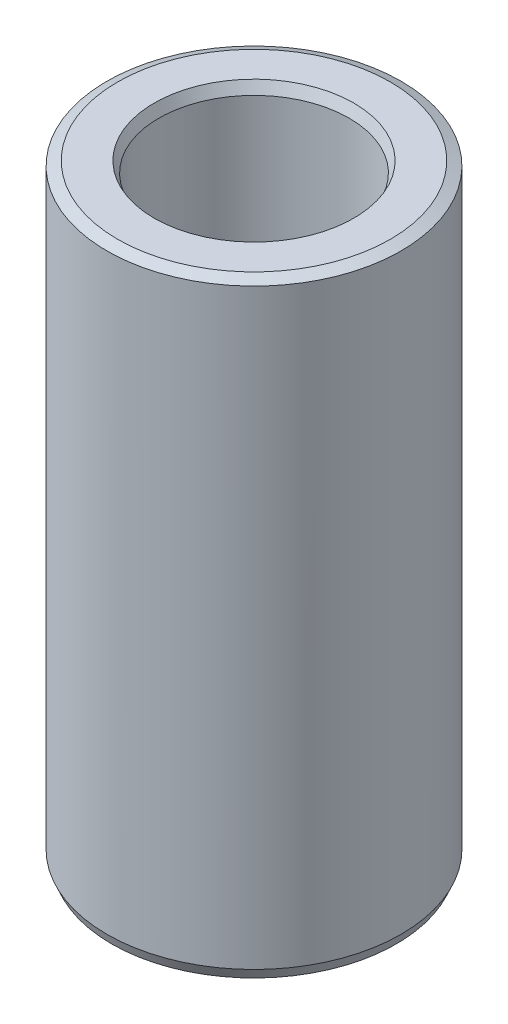
ISO-10303-21;
HEADER;
FILE_DESCRIPTION(('STEP AP214'),'2;1');
FILE_NAME('part.step','',(''),(''),'','','');
FILE_SCHEMA(('AUTOMOTIVE_DESIGN { 1 0 10303 214 1 1 1 1 }'));
ENDSEC;
DATA;
#1=APPLICATION_CONTEXT('core data for automotive mechanical design processes');
#2=APPLICATION_PROTOCOL_DEFINITION('international standard','automotive_design',2000,#1);
#3=PRODUCT_CONTEXT('',#1,'mechanical');
#4=PRODUCT('Part','Part','',(#3));
#5=PRODUCT_RELATED_PRODUCT_CATEGORY('part','',(#4));
#6=PRODUCT_DEFINITION_FORMATION('','',#4);
#7=PRODUCT_DEFINITION_CONTEXT('part definition',#1,'design');
#8=PRODUCT_DEFINITION('design','',#6,#7);
#9=PRODUCT_DEFINITION_SHAPE('','',#8);
#10=(LENGTH_UNIT() NAMED_UNIT(*) SI_UNIT(.MILLI.,.METRE.));
#11=(NAMED_UNIT(*) PLANE_ANGLE_UNIT() SI_UNIT($,.RADIAN.));
#12=(NAMED_UNIT(*) SI_UNIT($,.STERADIAN.) SOLID_ANGLE_UNIT());
#13=UNCERTAINTY_MEASURE_WITH_UNIT(LENGTH_MEASURE(1.E-05),#10,'distance_accuracy_value','');
#14=(GEOMETRIC_REPRESENTATION_CONTEXT(3) GLOBAL_UNCERTAINTY_ASSIGNED_CONTEXT((#13)) GLOBAL_UNIT_ASSIGNED_CONTEXT((#10,
#11,#12)) REPRESENTATION_CONTEXT('',''));
#15=CARTESIAN_POINT('',(0.,0.,0.));
#16=DIRECTION('',(0.,0.,1.));
#17=DIRECTION('',(1.,0.,0.));
#18=AXIS2_PLACEMENT_3D('',#15,#16,#17);
#19=CARTESIAN_POINT('',(0.,123.885257495903,0.));
#20=DIRECTION('',(0.,-1.,0.));
#21=DIRECTION('',(0.,0.,-1.));
#22=AXIS2_PLACEMENT_3D('',#19,#20,#21);
#23=CYLINDRICAL_SURFACE('',#22,30.);
#24=CARTESIAN_POINT('',(0.,2.1864745211929,0.));
#25=DIRECTION('',(0.,1.,0.));
#26=DIRECTION('',(0.,0.,1.));
#27=AXIS2_PLACEMENT_3D('',#24,#25,#26);
#28=CIRCLE('',#27,30.);
#29=CARTESIAN_POINT('',(0.,2.1864745211929,30.));
#30=VERTEX_POINT('',#29);
#31=EDGE_CURVE('E10',#30,#30,#28,.T.);
#32=ORIENTED_EDGE('',*,*,#31,.T.);
#33=EDGE_LOOP('',(#32));
#34=FACE_BOUND('',#33,.T.);
#35=CARTESIAN_POINT('',(0.,122.923997597913,0.));
#36=DIRECTION('',(0.,1.,0.));
#37=DIRECTION('',(0.,0.,1.));
#38=AXIS2_PLACEMENT_3D('',#35,#36,#37);
#39=CIRCLE('',#38,30.);
#40=CARTESIAN_POINT('',(0.,122.923997597913,-30.));
#41=VERTEX_POINT('',#40);
#42=EDGE_CURVE('E50',#41,#41,#39,.F.);
#43=ORIENTED_EDGE('',*,*,#42,.T.);
#44=EDGE_LOOP('',(#43));
#45=FACE_BOUND('',#44,.T.);
#46=ADVANCED_FACE('F39',(#34,#45),#23,.T.);
#47=CARTESIAN_POINT('',(0.,123.885257495903,0.));
#48=DIRECTION('',(0.,1.,0.));
#49=DIRECTION('',(0.,0.,1.));
#50=AXIS2_PLACEMENT_3D('',#47,#48,#49);
#51=PLANE('',#50);
#52=CARTESIAN_POINT('',(0.,123.885257495903,0.));
#53=DIRECTION('',(0.,1.,0.));
#54=DIRECTION('',(0.,0.,1.));
#55=AXIS2_PLACEMENT_3D('',#52,#53,#54);
#56=CIRCLE('',#55,20.3596697328622);
#57=CARTESIAN_POINT('',(0.,123.885257495903,20.3596697328622));
#58=VERTEX_POINT('',#57);
#59=EDGE_CURVE('E58',#58,#58,#56,.F.);
#60=ORIENTED_EDGE('',*,*,#59,.T.);
#61=EDGE_LOOP('',(#60));
#62=FACE_BOUND('',#61,.T.);
#63=CARTESIAN_POINT('',(0.,123.885257495903,0.));
#64=DIRECTION('',(0.,1.,0.));
#65=DIRECTION('',(0.,0.,1.));
#66=AXIS2_PLACEMENT_3D('',#63,#64,#65);
#67=CIRCLE('',#66,27.813525478807);
#68=CARTESIAN_POINT('',(0.,123.885257495903,-27.813525478807));
#69=VERTEX_POINT('',#68);
#70=EDGE_CURVE('E61',#69,#69,#67,.T.);
#71=ORIENTED_EDGE('',*,*,#70,.T.);
#72=EDGE_LOOP('',(#71));
#73=FACE_BOUND('',#72,.T.);
#74=ADVANCED_FACE('F88',(#62,#73),#51,.T.);
#75=CARTESIAN_POINT('',(0.,0.,0.));
#76=DIRECTION('',(0.,1.,0.));
#77=DIRECTION('',(0.,0.,1.));
#78=AXIS2_PLACEMENT_3D('',#75,#76,#77);
#79=PLANE('',#78);
#80=CARTESIAN_POINT('',(0.,0.,0.));
#81=DIRECTION('',(0.,1.,0.));
#82=DIRECTION('',(0.,0.,1.));
#83=AXIS2_PLACEMENT_3D('',#80,#81,#82);
#84=CIRCLE('',#83,21.5848843560652);
#85=CARTESIAN_POINT('',(0.,0.,-21.5848843560652));
#86=VERTEX_POINT('',#85);
#87=EDGE_CURVE('E51',#86,#86,#84,.T.);
#88=ORIENTED_EDGE('',*,*,#87,.T.);
#89=EDGE_LOOP('',(#88));
#90=FACE_BOUND('',#89,.T.);
#91=CARTESIAN_POINT('',(0.,0.,0.));
#92=DIRECTION('',(0.,1.,0.));
#93=DIRECTION('',(0.,0.,1.));
#94=AXIS2_PLACEMENT_3D('',#91,#92,#93);
#95=CIRCLE('',#94,29.0387401020101);
#96=CARTESIAN_POINT('',(0.,0.,29.0387401020101));
#97=VERTEX_POINT('',#96);
#98=EDGE_CURVE('E54',#97,#97,#95,.F.);
#99=ORIENTED_EDGE('',*,*,#98,.T.);
#100=EDGE_LOOP('',(#99));
#101=FACE_BOUND('',#100,.T.);
#102=ADVANCED_FACE('F83',(#90,#101),#79,.F.);
#103=CARTESIAN_POINT('',(0.,123.885257495903,0.));
#104=DIRECTION('',(0.,-1.,0.));
#105=DIRECTION('',(0.,0.,-1.));
#106=AXIS2_PLACEMENT_3D('',#103,#104,#105);
#107=CYLINDRICAL_SURFACE('',#106,19.3984098348722);
#108=CARTESIAN_POINT('',(0.,121.69878297471,0.));
#109=DIRECTION('',(0.,1.,0.));
#110=DIRECTION('',(0.,0.,1.));
#111=AXIS2_PLACEMENT_3D('',#108,#109,#110);
#112=CIRCLE('',#111,19.3984098348722);
#113=CARTESIAN_POINT('',(0.,121.69878297471,19.3984098348722));
#114=VERTEX_POINT('',#113);
#115=EDGE_CURVE('E67',#114,#114,#112,.T.);
#116=ORIENTED_EDGE('',*,*,#115,.T.);
#117=EDGE_LOOP('',(#116));
#118=FACE_BOUND('',#117,.T.);
#119=CARTESIAN_POINT('',(0.,0.961259897989966,0.));
#120=DIRECTION('',(0.,1.,0.));
#121=DIRECTION('',(0.,0.,1.));
#122=AXIS2_PLACEMENT_3D('',#119,#120,#121);
#123=CIRCLE('',#122,19.3984098348722);
#124=CARTESIAN_POINT('',(0.,0.961259897989966,-19.3984098348722));
#125=VERTEX_POINT('',#124);
#126=EDGE_CURVE('E69',#125,#125,#123,.F.);
#127=ORIENTED_EDGE('',*,*,#126,.T.);
#128=EDGE_LOOP('',(#127));
#129=FACE_BOUND('',#128,.T.);
#130=ADVANCED_FACE('F71',(#118,#129),#107,.F.);
#131=CARTESIAN_POINT('',(0.,121.69878297471,0.));
#132=DIRECTION('',(0.,1.,0.));
#133=DIRECTION('',(0.,0.,1.));
#134=AXIS2_PLACEMENT_3D('',#131,#132,#133);
#135=CONICAL_SURFACE('',#134,19.3984098348722,0.414204551222729);
#136=ORIENTED_EDGE('',*,*,#59,.F.);
#137=EDGE_LOOP('',(#136));
#138=FACE_BOUND('',#137,.T.);
#139=ORIENTED_EDGE('',*,*,#115,.F.);
#140=EDGE_LOOP('',(#139));
#141=FACE_BOUND('',#140,.T.);
#142=ADVANCED_FACE('F77',(#138,#141),#135,.F.);
#143=CARTESIAN_POINT('',(0.,0.,0.));
#144=DIRECTION('',(0.,-1.,0.));
#145=DIRECTION('',(0.,0.,-1.));
#146=AXIS2_PLACEMENT_3D('',#143,#144,#145);
#147=CONICAL_SURFACE('',#146,21.5848843560652,1.15659177557217);
#148=CARTESIAN_POINT('',(0.,0.961259897989966,-19.3984098348722));
#149=CARTESIAN_POINT('',(0.,0.951246774052571,-19.4211856111346));
#150=CARTESIAN_POINT('',(0.,0.941233650115175,-19.443961387397));
#151=CARTESIAN_POINT('',(0.,0.921207402240384,-19.4895129399219));
#152=CARTESIAN_POINT('',(0.,0.911194278302989,-19.5122887161843));
#153=CARTESIAN_POINT('',(0.,0.891168030428198,-19.5578402687092));
#154=CARTESIAN_POINT('',(0.,0.881154906490802,-19.5806160449716));
#155=CARTESIAN_POINT('',(0.,0.861128658616011,-19.6261675974965));
#156=CARTESIAN_POINT('',(0.,0.851115534678616,-19.6489433737589));
#157=CARTESIAN_POINT('',(0.,0.831089286803825,-19.6944949262838));
#158=CARTESIAN_POINT('',(0.,0.821076162866429,-19.7172707025462));
#159=CARTESIAN_POINT('',(0.,0.801049914991638,-19.762822255071));
#160=CARTESIAN_POINT('',(0.,0.791036791054243,-19.7855980313335));
#161=CARTESIAN_POINT('',(0.,0.771010543179452,-19.8311495838583));
#162=CARTESIAN_POINT('',(0.,0.760997419242056,-19.8539253601207));
#163=CARTESIAN_POINT('',(0.,0.740971171367266,-19.8994769126456));
#164=CARTESIAN_POINT('',(0.,0.73095804742987,-19.922252688908));
#165=CARTESIAN_POINT('',(0.,0.710931799555079,-19.9678042414329));
#166=CARTESIAN_POINT('',(0.,0.700918675617683,-19.9905800176953));
#167=CARTESIAN_POINT('',(0.,0.680892427742892,-20.0361315702202));
#168=CARTESIAN_POINT('',(0.,0.670879303805497,-20.0589073464826));
#169=CARTESIAN_POINT('',(0.,0.650853055930706,-20.1044588990074));
#170=CARTESIAN_POINT('',(0.,0.640839931993311,-20.1272346752699));
#171=CARTESIAN_POINT('',(0.,0.62081368411852,-20.1727862277947));
#172=CARTESIAN_POINT('',(0.,0.610800560181124,-20.1955620040572));
#173=CARTESIAN_POINT('',(0.,0.590774312306333,-20.241113556582));
#174=CARTESIAN_POINT('',(0.,0.580761188368938,-20.2638893328444));
#175=CARTESIAN_POINT('',(0.,0.560734940494147,-20.3094408853693));
#176=CARTESIAN_POINT('',(0.,0.550721816556751,-20.3322166616317));
#177=CARTESIAN_POINT('',(0.,0.53069556868196,-20.3777682141566));
#178=CARTESIAN_POINT('',(0.,0.520682444744565,-20.400543990419));
#179=CARTESIAN_POINT('',(0.,0.500656196869774,-20.4460955429439));
#180=CARTESIAN_POINT('',(0.,0.490643072932378,-20.4688713192063));
#181=CARTESIAN_POINT('',(0.,0.470616825057588,-20.5144228717311));
#182=CARTESIAN_POINT('',(0.,0.460603701120192,-20.5371986479936));
#183=CARTESIAN_POINT('',(0.,0.440577453245401,-20.5827502005184));
#184=CARTESIAN_POINT('',(0.,0.430564329308006,-20.6055259767808));
#185=CARTESIAN_POINT('',(0.,0.410538081433215,-20.6510775293057));
#186=CARTESIAN_POINT('',(0.,0.400524957495819,-20.6738533055681));
#187=CARTESIAN_POINT('',(0.,0.380498709621028,-20.719404858093));
#188=CARTESIAN_POINT('',(0.,0.370485585683633,-20.7421806343554));
#189=CARTESIAN_POINT('',(0.,0.350459337808842,-20.7877321868803));
#190=CARTESIAN_POINT('',(0.,0.340446213871446,-20.8105079631427));
#191=CARTESIAN_POINT('',(0.,0.320419965996655,-20.8560595156675));
#192=CARTESIAN_POINT('',(0.,0.31040684205926,-20.87883529193));
#193=CARTESIAN_POINT('',(0.,0.290380594184469,-20.9243868444548));
#194=CARTESIAN_POINT('',(0.,0.280367470247074,-20.9471626207173));
#195=CARTESIAN_POINT('',(0.,0.260341222372283,-20.9927141732421));
#196=CARTESIAN_POINT('',(0.,0.250328098434887,-21.0154899495045));
#197=CARTESIAN_POINT('',(0.,0.230301850560096,-21.0610415020294));
#198=CARTESIAN_POINT('',(0.,0.2202887266227,-21.0838172782918));
#199=CARTESIAN_POINT('',(0.,0.20026247874791,-21.1293688308167));
#200=CARTESIAN_POINT('',(0.,0.190249354810514,-21.1521446070791));
#201=CARTESIAN_POINT('',(0.,0.170223106935723,-21.197696159604));
#202=CARTESIAN_POINT('',(0.,0.160209982998328,-21.2204719358664));
#203=CARTESIAN_POINT('',(0.,0.140183735123537,-21.2660234883912));
#204=CARTESIAN_POINT('',(0.,0.130170611186141,-21.2887992646537));
#205=CARTESIAN_POINT('',(0.,0.11014436331135,-21.3343508171785));
#206=CARTESIAN_POINT('',(0.,0.100131239373955,-21.3571265934409));
#207=CARTESIAN_POINT('',(0.,0.0801049914991638,-21.4026781459658));
#208=CARTESIAN_POINT('',(0.,0.0700918675617684,-21.4254539222282));
#209=CARTESIAN_POINT('',(0.,0.0500656196869774,-21.4710054747531));
#210=CARTESIAN_POINT('',(0.,0.0400524957495819,-21.4937812510155));
#211=CARTESIAN_POINT('',(0.,0.020026247874791,-21.5393328035404));
#212=CARTESIAN_POINT('',(0.,0.0100131239373955,-21.5621085798028));
#213=CARTESIAN_POINT('',(0.,0.,-21.5848843560652));
#214=B_SPLINE_CURVE_WITH_KNOTS('',3,(#148,#149,#150,#151,#152,#153,#154,#155,#156,#157,#158,
#159,#160,#161,#162,#163,#164,#165,#166,#167,#168,#169,#170,#171,#172,#173,#174,#175,#176,#177,
#178,#179,#180,#181,#182,#183,#184,#185,#186,#187,#188,#189,#190,#191,#192,#193,#194,#195,#196,
#197,#198,#199,#200,#201,#202,#203,#204,#205,#206,#207,#208,#209,#210,#211,#212,#213),
.UNSPECIFIED.,.F.,.F.,(4,2,2,2,2,2,2,2,2,2,2,2,2,2,2,2,2,2,2,2,2,2,2,2,2,2,2,2,2,2,2,2,4),(0.,
0.0746390495523364,0.149278099104673,0.223917148657009,0.298556198209346,0.373195247761682,
0.447834297314018,0.522473346866355,0.597112396418691,0.671751445971025,0.746390495523361,
0.821029545075697,0.895668594628034,0.97030764418037,1.04494669373271,1.11958574328504,
1.19422479283738,1.26886384238972,1.34350289194205,1.41814194149439,1.49278099104673,
1.56742004059906,1.6420590901514,1.71669813970373,1.79133718925607,1.8659762388084,
1.94061528836074,2.01525433791308,2.08989338746541,2.16453243701775,2.23917148657009,
2.31381053612242,2.38844958567476),.UNSPECIFIED.);
#215=EDGE_CURVE('BSEAM73',#125,#86,#214,.T.);
#216=ORIENTED_EDGE('',*,*,#126,.F.);
#217=ORIENTED_EDGE('',*,*,#87,.F.);
#218=ORIENTED_EDGE('',*,*,#215,.T.);
#219=ORIENTED_EDGE('',*,*,#215,.F.);
#220=EDGE_LOOP('',(#216,#218,#217,#219));
#221=FACE_BOUND('',#220,.T.);
#222=ADVANCED_FACE('F73',(#221),#147,.F.);
#223=CARTESIAN_POINT('',(0.,2.1864745211929,0.));
#224=DIRECTION('',(0.,1.,0.));
#225=DIRECTION('',(0.,0.,1.));
#226=AXIS2_PLACEMENT_3D('',#223,#224,#225);
#227=CONICAL_SURFACE('',#226,30.,0.414204551222733);
#228=ORIENTED_EDGE('',*,*,#98,.F.);
#229=EDGE_LOOP('',(#228));
#230=FACE_BOUND('',#229,.T.);
#231=ORIENTED_EDGE('',*,*,#31,.F.);
#232=EDGE_LOOP('',(#231));
#233=FACE_BOUND('',#232,.T.);
#234=ADVANCED_FACE('F76',(#230,#233),#227,.T.);
#235=CARTESIAN_POINT('',(0.,123.885257495903,0.));
#236=DIRECTION('',(0.,-1.,0.));
#237=DIRECTION('',(0.,0.,-1.));
#238=AXIS2_PLACEMENT_3D('',#235,#236,#237);
#239=CONICAL_SURFACE('',#238,27.813525478807,1.15659177557217);
#240=CARTESIAN_POINT('',(0.,122.923997597913,-30.));
#241=CARTESIAN_POINT('',(0.,122.934010721851,-29.9772242237376));
#242=CARTESIAN_POINT('',(0.,122.944023845788,-29.9544484474752));
#243=CARTESIAN_POINT('',(0.,122.964050093663,-29.9088968949503));
#244=CARTESIAN_POINT('',(0.,122.9740632176,-29.8861211186879));
#245=CARTESIAN_POINT('',(0.,122.994089465475,-29.840569566163));
#246=CARTESIAN_POINT('',(0.,123.004102589412,-29.8177937899006));
#247=CARTESIAN_POINT('',(0.,123.024128837287,-29.7722422373757));
#248=CARTESIAN_POINT('',(0.,123.034141961225,-29.7494664611133));
#249=CARTESIAN_POINT('',(0.,123.054168209099,-29.7039149085885));
#250=CARTESIAN_POINT('',(0.,123.064181333037,-29.681139132326));
#251=CARTESIAN_POINT('',(0.,123.084207580912,-29.6355875798012));
#252=CARTESIAN_POINT('',(0.,123.094220704849,-29.6128118035387));
#253=CARTESIAN_POINT('',(0.,123.114246952724,-29.5672602510139));
#254=CARTESIAN_POINT('',(0.,123.124260076661,-29.5444844747515));
#255=CARTESIAN_POINT('',(0.,123.144286324536,-29.4989329222266));
#256=CARTESIAN_POINT('',(0.,123.154299448473,-29.4761571459642));
#257=CARTESIAN_POINT('',(0.,123.174325696348,-29.4306055934393));
#258=CARTESIAN_POINT('',(0.,123.184338820286,-29.4078298171769));
#259=CARTESIAN_POINT('',(0.,123.20436506816,-29.362278264652));
#260=CARTESIAN_POINT('',(0.,123.214378192098,-29.3395024883896));
#261=CARTESIAN_POINT('',(0.,123.234404439973,-29.2939509358648));
#262=CARTESIAN_POINT('',(0.,123.24441756391,-29.2711751596023));
#263=CARTESIAN_POINT('',(0.,123.264443811785,-29.2256236070775));
#264=CARTESIAN_POINT('',(0.,123.274456935722,-29.2028478308151));
#265=CARTESIAN_POINT('',(0.,123.294483183597,-29.1572962782902));
#266=CARTESIAN_POINT('',(0.,123.304496307534,-29.1345205020278));
#267=CARTESIAN_POINT('',(0.,123.324522555409,-29.0889689495029));
#268=CARTESIAN_POINT('',(0.,123.334535679346,-29.0661931732405));
#269=CARTESIAN_POINT('',(0.,123.354561927221,-29.0206416207156));
#270=CARTESIAN_POINT('',(0.,123.364575051159,-28.9978658444532));
#271=CARTESIAN_POINT('',(0.,123.384601299033,-28.9523142919284));
#272=CARTESIAN_POINT('',(0.,123.394614422971,-28.9295385156659));
#273=CARTESIAN_POINT('',(0.,123.414640670846,-28.8839869631411));
#274=CARTESIAN_POINT('',(0.,123.424653794783,-28.8612111868786));
#275=CARTESIAN_POINT('',(0.,123.444680042658,-28.8156596343538));
#276=CARTESIAN_POINT('',(0.,123.454693166595,-28.7928838580914));
#277=CARTESIAN_POINT('',(0.,123.47471941447,-28.7473323055665));
#278=CARTESIAN_POINT('',(0.,123.484732538407,-28.7245565293041));
#279=CARTESIAN_POINT('',(0.,123.504758786282,-28.6790049767792));
#280=CARTESIAN_POINT('',(0.,123.51477191022,-28.6562292005168));
#281=CARTESIAN_POINT('',(0.,123.534798158094,-28.6106776479919));
#282=CARTESIAN_POINT('',(0.,123.544811282032,-28.5879018717295));
#283=CARTESIAN_POINT('',(0.,123.564837529907,-28.5423503192047));
#284=CARTESIAN_POINT('',(0.,123.574850653844,-28.5195745429422));
#285=CARTESIAN_POINT('',(0.,123.594876901719,-28.4740229904174));
#286=CARTESIAN_POINT('',(0.,123.604890025656,-28.451247214155));
#287=CARTESIAN_POINT('',(0.,123.624916273531,-28.4056956616301));
#288=CARTESIAN_POINT('',(0.,123.634929397468,-28.3829198853677));
#289=CARTESIAN_POINT('',(0.,123.654955645343,-28.3373683328428));
#290=CARTESIAN_POINT('',(0.,123.664968769281,-28.3145925565804));
#291=CARTESIAN_POINT('',(0.,123.684995017155,-28.2690410040555));
#292=CARTESIAN_POINT('',(0.,123.695008141093,-28.2462652277931));
#293=CARTESIAN_POINT('',(0.,123.715034388967,-28.2007136752683));
#294=CARTESIAN_POINT('',(0.,123.725047512905,-28.1779378990058));
#295=CARTESIAN_POINT('',(0.,123.74507376078,-28.132386346481));
#296=CARTESIAN_POINT('',(0.,123.755086884717,-28.1096105702185));
#297=CARTESIAN_POINT('',(0.,123.775113132592,-28.0640590176937));
#298=CARTESIAN_POINT('',(0.,123.785126256529,-28.0412832414313));
#299=CARTESIAN_POINT('',(0.,123.805152504404,-27.9957316889064));
#300=CARTESIAN_POINT('',(0.,123.815165628341,-27.972955912644));
#301=CARTESIAN_POINT('',(0.,123.835191876216,-27.9274043601191));
#302=CARTESIAN_POINT('',(0.,123.845205000154,-27.9046285838567));
#303=CARTESIAN_POINT('',(0.,123.865231248028,-27.8590770313318));
#304=CARTESIAN_POINT('',(0.,123.875244371966,-27.8363012550694));
#305=CARTESIAN_POINT('',(0.,123.885257495903,-27.813525478807));
#306=B_SPLINE_CURVE_WITH_KNOTS('',3,(#240,#241,#242,#243,#244,#245,#246,#247,#248,#249,#250,
#251,#252,#253,#254,#255,#256,#257,#258,#259,#260,#261,#262,#263,#264,#265,#266,#267,#268,#269,
#270,#271,#272,#273,#274,#275,#276,#277,#278,#279,#280,#281,#282,#283,#284,#285,#286,#287,#288,
#289,#290,#291,#292,#293,#294,#295,#296,#297,#298,#299,#300,#301,#302,#303,#304,#305),
.UNSPECIFIED.,.F.,.F.,(4,2,2,2,2,2,2,2,2,2,2,2,2,2,2,2,2,2,2,2,2,2,2,2,2,2,2,2,2,2,2,2,4),(0.,
0.0746390495523313,0.149278099104668,0.223917148657005,0.298556198209342,0.373195247761679,
0.447834297314016,0.522473346866353,0.59711239641869,0.671751445971027,0.746390495523364,
0.821029545075695,0.895668594628032,0.970307644180369,1.04494669373271,1.11958574328504,
1.19422479283738,1.26886384238972,1.34350289194205,1.41814194149439,1.49278099104672,
1.56742004059906,1.64205909015139,1.71669813970373,1.79133718925607,1.8659762388084,
1.94061528836074,2.01525433791308,2.08989338746541,2.16453243701775,2.23917148657009,
2.31381053612242,2.38844958567476),.UNSPECIFIED.);
#307=EDGE_CURVE('BSEAM45',#41,#69,#306,.T.);
#308=ORIENTED_EDGE('',*,*,#42,.F.);
#309=ORIENTED_EDGE('',*,*,#70,.F.);
#310=ORIENTED_EDGE('',*,*,#307,.T.);
#311=ORIENTED_EDGE('',*,*,#307,.F.);
#312=EDGE_LOOP('',(#308,#310,#309,#311));
#313=FACE_BOUND('',#312,.T.);
#314=ADVANCED_FACE('F45',(#313),#239,.T.);
#315=CLOSED_SHELL('',(#46,#74,#102,#130,#142,#222,#234,#314));
#316=MANIFOLD_SOLID_BREP('B2',#315);
#317=ADVANCED_BREP_SHAPE_REPRESENTATION('',(#18,#316),#14);
#318=SHAPE_DEFINITION_REPRESENTATION(#9,#317);
ENDSEC;
END-ISO-10303-21;
